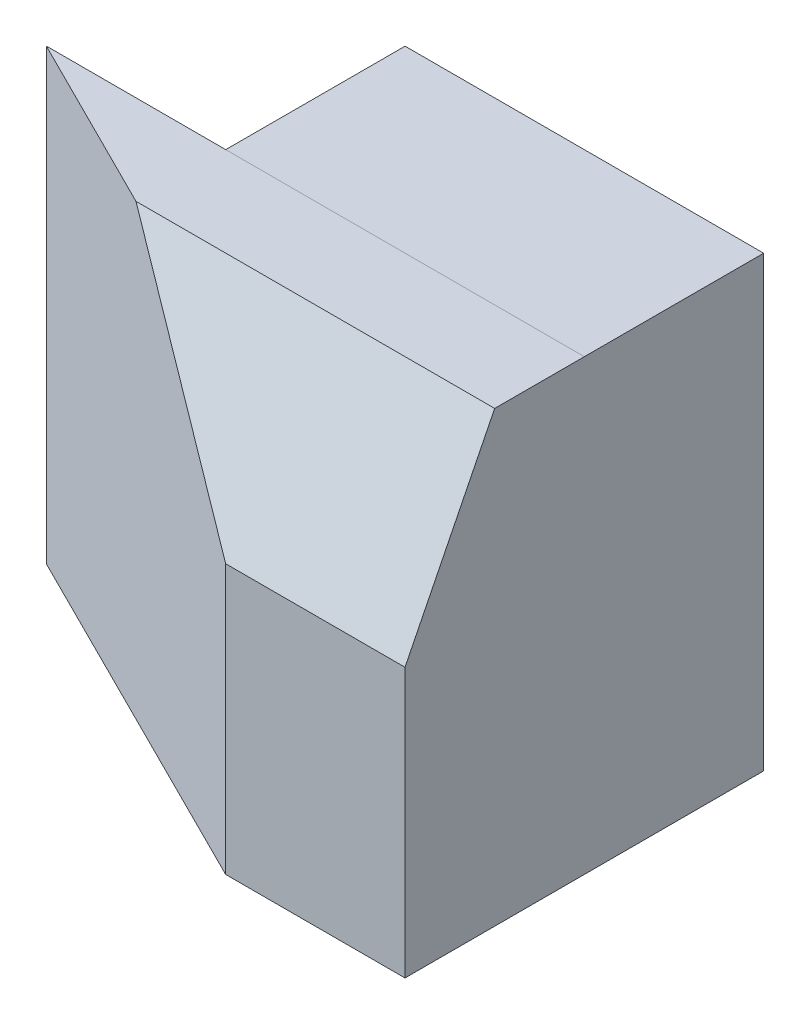
ISO-10303-21;
HEADER;
FILE_DESCRIPTION(('STEP AP214'),'2;1');
FILE_NAME('part.step','',(''),(''),'','','');
FILE_SCHEMA(('AUTOMOTIVE_DESIGN { 1 0 10303 214 1 1 1 1 }'));
ENDSEC;
DATA;
#1=APPLICATION_CONTEXT('core data for automotive mechanical design processes');
#2=APPLICATION_PROTOCOL_DEFINITION('international standard','automotive_design',2000,#1);
#3=PRODUCT_CONTEXT('',#1,'mechanical');
#4=PRODUCT('Part','Part','',(#3));
#5=PRODUCT_RELATED_PRODUCT_CATEGORY('part','',(#4));
#6=PRODUCT_DEFINITION_FORMATION('','',#4);
#7=PRODUCT_DEFINITION_CONTEXT('part definition',#1,'design');
#8=PRODUCT_DEFINITION('design','',#6,#7);
#9=PRODUCT_DEFINITION_SHAPE('','',#8);
#10=(LENGTH_UNIT() NAMED_UNIT(*) SI_UNIT(.MILLI.,.METRE.));
#11=(NAMED_UNIT(*) PLANE_ANGLE_UNIT() SI_UNIT($,.RADIAN.));
#12=(NAMED_UNIT(*) SI_UNIT($,.STERADIAN.) SOLID_ANGLE_UNIT());
#13=UNCERTAINTY_MEASURE_WITH_UNIT(LENGTH_MEASURE(1.E-05),#10,'distance_accuracy_value','');
#14=(GEOMETRIC_REPRESENTATION_CONTEXT(3) GLOBAL_UNCERTAINTY_ASSIGNED_CONTEXT((#13)) GLOBAL_UNIT_ASSIGNED_CONTEXT((#10,
#11,#12)) REPRESENTATION_CONTEXT('',''));
#15=CARTESIAN_POINT('',(0.,0.,0.));
#16=DIRECTION('',(0.,0.,1.));
#17=DIRECTION('',(1.,0.,0.));
#18=AXIS2_PLACEMENT_3D('',#15,#16,#17);
#19=CARTESIAN_POINT('',(0.,0.,2.));
#20=DIRECTION('',(0.,1.,0.));
#21=DIRECTION('',(0.,0.,1.));
#22=AXIS2_PLACEMENT_3D('',#19,#20,#21);
#23=PLANE('',#22);
#24=DIRECTION('',(-1.,0.,0.));
#25=VECTOR('',#24,1.);
#26=CARTESIAN_POINT('',(4.,0.,2.));
#27=LINE('',#26,#25);
#28=CARTESIAN_POINT('',(4.,0.,2.));
#29=VERTEX_POINT('',#28);
#30=CARTESIAN_POINT('',(0.,0.,2.));
#31=VERTEX_POINT('',#30);
#32=EDGE_CURVE('E111',#29,#31,#27,.T.);
#33=ORIENTED_EDGE('',*,*,#32,.F.);
#34=DIRECTION('',(0.,0.,-1.));
#35=VECTOR('',#34,1.);
#36=CARTESIAN_POINT('',(4.,0.,2.));
#37=LINE('',#36,#35);
#38=CARTESIAN_POINT('',(4.,0.,0.));
#39=VERTEX_POINT('',#38);
#40=EDGE_CURVE('E110',#29,#39,#37,.T.);
#41=ORIENTED_EDGE('',*,*,#40,.T.);
#42=DIRECTION('',(1.,0.,0.));
#43=VECTOR('',#42,1.);
#44=CARTESIAN_POINT('',(0.,0.,0.));
#45=LINE('',#44,#43);
#46=CARTESIAN_POINT('',(6.,0.,0.));
#47=VERTEX_POINT('',#46);
#48=EDGE_CURVE('E244',#39,#47,#45,.T.);
#49=ORIENTED_EDGE('',*,*,#48,.T.);
#50=DIRECTION('',(0.,0.,-1.));
#51=VECTOR('',#50,1.);
#52=CARTESIAN_POINT('',(6.,0.,2.));
#53=LINE('',#52,#51);
#54=CARTESIAN_POINT('',(6.,0.,4.));
#55=VERTEX_POINT('',#54);
#56=EDGE_CURVE('E180',#55,#47,#53,.T.);
#57=ORIENTED_EDGE('',*,*,#56,.F.);
#58=DIRECTION('',(1.,0.,0.));
#59=VECTOR('',#58,1.);
#60=CARTESIAN_POINT('',(6.,0.,4.));
#61=LINE('',#60,#59);
#62=CARTESIAN_POINT('',(4.,0.,4.));
#63=VERTEX_POINT('',#62);
#64=EDGE_CURVE('E160',#63,#55,#61,.T.);
#65=ORIENTED_EDGE('',*,*,#64,.F.);
#66=DIRECTION('',(-0.894427190999916,0.,-0.447213595499958));
#67=VECTOR('',#66,1.);
#68=CARTESIAN_POINT('',(4.,0.,4.));
#69=LINE('',#68,#67);
#70=EDGE_CURVE('E147',#63,#31,#69,.T.);
#71=ORIENTED_EDGE('',*,*,#70,.T.);
#72=EDGE_LOOP('',(#33,#41,#49,#57,#65,#71));
#73=FACE_BOUND('',#72,.T.);
#74=ADVANCED_FACE('F38',(#73),#23,.F.);
#75=CARTESIAN_POINT('',(6.,5.00106876189932,4.));
#76=DIRECTION('',(0.,-1.,0.));
#77=DIRECTION('',(0.,0.,-1.));
#78=AXIS2_PLACEMENT_3D('',#75,#76,#77);
#79=PLANE('',#78);
#80=DIRECTION('',(-0.894427190999916,0.,-0.447213595499958));
#81=VECTOR('',#80,1.);
#82=CARTESIAN_POINT('',(2.,5.00106876189932,3.));
#83=LINE('',#82,#81);
#84=CARTESIAN_POINT('',(2.,5.00106876189932,3.));
#85=VERTEX_POINT('',#84);
#86=CARTESIAN_POINT('',(0.,5.00106876189932,2.));
#87=VERTEX_POINT('',#86);
#88=EDGE_CURVE('E133',#85,#87,#83,.T.);
#89=ORIENTED_EDGE('',*,*,#88,.F.);
#90=DIRECTION('',(1.,0.,0.));
#91=VECTOR('',#90,1.);
#92=CARTESIAN_POINT('',(6.,5.00106876189932,3.));
#93=LINE('',#92,#91);
#94=CARTESIAN_POINT('',(6.,5.00106876189932,3.));
#95=VERTEX_POINT('',#94);
#96=EDGE_CURVE('E188',#85,#95,#93,.T.);
#97=ORIENTED_EDGE('',*,*,#96,.T.);
#98=DIRECTION('',(0.,0.,-1.));
#99=VECTOR('',#98,1.);
#100=CARTESIAN_POINT('',(6.,5.00106876189932,4.));
#101=LINE('',#100,#99);
#102=CARTESIAN_POINT('',(6.,5.00053438094966,2.));
#103=VERTEX_POINT('',#102);
#104=EDGE_CURVE('E167',#95,#103,#101,.T.);
#105=ORIENTED_EDGE('',*,*,#104,.T.);
#106=CARTESIAN_POINT('',(6.,5.00106876189932,2.));
#107=DIRECTION('',(-1.,0.,0.));
#108=VECTOR('',#107,1.);
#109=LINE('',#106,#108);
#110=CARTESIAN_POINT('',(2.00053438094966,5.00053438094966,2.));
#111=VERTEX_POINT('',#110);
#112=EDGE_CURVE('E195',#103,#111,#109,.T.);
#113=ORIENTED_EDGE('',*,*,#112,.T.);
#114=DIRECTION('',(1.,0.,0.));
#115=VECTOR('',#114,1.);
#116=CARTESIAN_POINT('',(0.,5.00106876189932,2.));
#117=LINE('',#116,#115);
#118=EDGE_CURVE('E123',#87,#111,#117,.T.);
#119=ORIENTED_EDGE('',*,*,#118,.F.);
#120=EDGE_LOOP('',(#89,#97,#105,#113,#119));
#121=FACE_BOUND('',#120,.T.);
#122=ADVANCED_FACE('F223',(#121),#79,.F.);
#123=CARTESIAN_POINT('',(0.,0.,4.));
#124=DIRECTION('',(0.,0.,1.));
#125=DIRECTION('',(1.,0.,0.));
#126=AXIS2_PLACEMENT_3D('',#123,#124,#125);
#127=PLANE('',#126);
#128=DIRECTION('',(-1.,0.,0.));
#129=VECTOR('',#128,1.);
#130=CARTESIAN_POINT('',(0.,3.00106876189932,4.));
#131=LINE('',#130,#129);
#132=CARTESIAN_POINT('',(6.,3.00106876189932,4.));
#133=VERTEX_POINT('',#132);
#134=CARTESIAN_POINT('',(4.,3.00106876189932,4.));
#135=VERTEX_POINT('',#134);
#136=EDGE_CURVE('E168',#133,#135,#131,.T.);
#137=ORIENTED_EDGE('',*,*,#136,.T.);
#138=DIRECTION('',(0.,-1.,0.));
#139=VECTOR('',#138,1.);
#140=CARTESIAN_POINT('',(4.,3.00106876189932,4.));
#141=LINE('',#140,#139);
#142=EDGE_CURVE('E56',#135,#63,#141,.T.);
#143=ORIENTED_EDGE('',*,*,#142,.T.);
#144=ORIENTED_EDGE('',*,*,#64,.T.);
#145=DIRECTION('',(0.,1.,0.));
#146=VECTOR('',#145,1.);
#147=CARTESIAN_POINT('',(6.,0.,4.));
#148=LINE('',#147,#146);
#149=EDGE_CURVE('E138',#55,#133,#148,.T.);
#150=ORIENTED_EDGE('',*,*,#149,.T.);
#151=EDGE_LOOP('',(#137,#143,#144,#150));
#152=FACE_BOUND('',#151,.T.);
#153=ADVANCED_FACE('F184',(#152),#127,.T.);
#154=CARTESIAN_POINT('',(0.,3.00106876189932,4.));
#155=DIRECTION('',(0.,0.447213595499958,0.894427190999916));
#156=DIRECTION('',(1.,0.,0.));
#157=AXIS2_PLACEMENT_3D('',#154,#155,#156);
#158=PLANE('',#157);
#159=ORIENTED_EDGE('',*,*,#96,.F.);
#160=DIRECTION('',(0.666666666666667,-0.666666666666667,0.333333333333333));
#161=VECTOR('',#160,1.);
#162=CARTESIAN_POINT('',(2.,5.00106876189932,3.));
#163=LINE('',#162,#161);
#164=EDGE_CURVE('E136',#85,#135,#163,.T.);
#165=ORIENTED_EDGE('',*,*,#164,.T.);
#166=ORIENTED_EDGE('',*,*,#136,.F.);
#167=DIRECTION('',(0.,-0.894427190999916,0.447213595499958));
#168=VECTOR('',#167,1.);
#169=CARTESIAN_POINT('',(6.,3.00106876189932,4.));
#170=LINE('',#169,#168);
#171=EDGE_CURVE('E48',#95,#133,#170,.T.);
#172=ORIENTED_EDGE('',*,*,#171,.F.);
#173=EDGE_LOOP('',(#159,#165,#166,#172));
#174=FACE_BOUND('',#173,.T.);
#175=ADVANCED_FACE('F40',(#174),#158,.T.);
#176=CARTESIAN_POINT('',(6.,0.,2.));
#177=DIRECTION('',(-1.,0.,0.));
#178=DIRECTION('',(0.,0.,1.));
#179=AXIS2_PLACEMENT_3D('',#176,#177,#178);
#180=PLANE('',#179);
#181=ORIENTED_EDGE('',*,*,#104,.F.);
#182=ORIENTED_EDGE('',*,*,#171,.T.);
#183=ORIENTED_EDGE('',*,*,#149,.F.);
#184=ORIENTED_EDGE('',*,*,#56,.T.);
#185=DIRECTION('',(0.,1.,0.));
#186=VECTOR('',#185,1.);
#187=CARTESIAN_POINT('',(6.,0.,0.));
#188=LINE('',#187,#186);
#189=CARTESIAN_POINT('',(6.,5.,0.));
#190=VERTEX_POINT('',#189);
#191=EDGE_CURVE('E254',#47,#190,#188,.T.);
#192=ORIENTED_EDGE('',*,*,#191,.T.);
#193=DIRECTION('',(0.,0.,-1.));
#194=VECTOR('',#193,1.);
#195=CARTESIAN_POINT('',(6.,5.,2.));
#196=LINE('',#195,#194);
#197=EDGE_CURVE('E189',#103,#190,#196,.T.);
#198=ORIENTED_EDGE('',*,*,#197,.F.);
#199=EDGE_LOOP('',(#181,#182,#183,#184,#192,#198));
#200=FACE_BOUND('',#199,.T.);
#201=ADVANCED_FACE('F219',(#200),#180,.F.);
#202=CARTESIAN_POINT('',(2.,5.,2.));
#203=DIRECTION('',(0.,-1.,0.));
#204=DIRECTION('',(0.,0.,-1.));
#205=AXIS2_PLACEMENT_3D('',#202,#203,#204);
#206=PLANE('',#205);
#207=DIRECTION('',(-1.,0.,0.));
#208=VECTOR('',#207,1.);
#209=CARTESIAN_POINT('',(2.,5.,0.));
#210=LINE('',#209,#208);
#211=CARTESIAN_POINT('',(2.00106876189932,5.,0.));
#212=VERTEX_POINT('',#211);
#213=EDGE_CURVE('E199',#190,#212,#210,.T.);
#214=ORIENTED_EDGE('',*,*,#213,.T.);
#215=DIRECTION('',(0.,0.,1.));
#216=VECTOR('',#215,1.);
#217=CARTESIAN_POINT('',(2.00106876189932,5.,2.));
#218=LINE('',#217,#216);
#219=EDGE_CURVE('E131',#212,#111,#218,.T.);
#220=ORIENTED_EDGE('',*,*,#219,.T.);
#221=ORIENTED_EDGE('',*,*,#112,.F.);
#222=ORIENTED_EDGE('',*,*,#197,.T.);
#223=EDGE_LOOP('',(#214,#220,#221,#222));
#224=FACE_BOUND('',#223,.T.);
#225=ADVANCED_FACE('F208',(#224),#206,.F.);
#226=CARTESIAN_POINT('',(0.,0.,0.));
#227=DIRECTION('',(0.,0.,1.));
#228=DIRECTION('',(1.,0.,0.));
#229=AXIS2_PLACEMENT_3D('',#226,#227,#228);
#230=PLANE('',#229);
#231=ORIENTED_EDGE('',*,*,#48,.F.);
#232=DIRECTION('',(0.,-1.,0.));
#233=VECTOR('',#232,1.);
#234=CARTESIAN_POINT('',(4.,3.00106876189932,0.));
#235=LINE('',#234,#233);
#236=CARTESIAN_POINT('',(4.,3.00106876189932,0.));
#237=VERTEX_POINT('',#236);
#238=EDGE_CURVE('E126',#237,#39,#235,.T.);
#239=ORIENTED_EDGE('',*,*,#238,.F.);
#240=DIRECTION('',(-0.707106781186548,0.707106781186548,0.));
#241=VECTOR('',#240,1.);
#242=CARTESIAN_POINT('',(3.50053438094966,3.50053438094966,0.));
#243=LINE('',#242,#241);
#244=EDGE_CURVE('E14',#237,#212,#243,.T.);
#245=ORIENTED_EDGE('',*,*,#244,.T.);
#246=ORIENTED_EDGE('',*,*,#213,.F.);
#247=ORIENTED_EDGE('',*,*,#191,.F.);
#248=EDGE_LOOP('',(#231,#239,#245,#246,#247));
#249=FACE_BOUND('',#248,.T.);
#250=ADVANCED_FACE('F218',(#249),#230,.F.);
#251=CARTESIAN_POINT('',(-0.8,0.,1.6));
#252=DIRECTION('',(-0.447213595499958,0.,0.894427190999916));
#253=DIRECTION('',(0.894427190999916,0.,0.447213595499958));
#254=AXIS2_PLACEMENT_3D('',#251,#252,#253);
#255=PLANE('',#254);
#256=ORIENTED_EDGE('',*,*,#164,.F.);
#257=ORIENTED_EDGE('',*,*,#88,.T.);
#258=DIRECTION('',(0.,-1.,0.));
#259=VECTOR('',#258,1.);
#260=CARTESIAN_POINT('',(0.,5.00106876189932,2.));
#261=LINE('',#260,#259);
#262=EDGE_CURVE('E143',#87,#31,#261,.T.);
#263=ORIENTED_EDGE('',*,*,#262,.T.);
#264=ORIENTED_EDGE('',*,*,#70,.F.);
#265=ORIENTED_EDGE('',*,*,#142,.F.);
#266=EDGE_LOOP('',(#256,#257,#263,#264,#265));
#267=FACE_BOUND('',#266,.T.);
#268=ADVANCED_FACE('F175',(#267),#255,.T.);
#269=CARTESIAN_POINT('',(2.,5.00106876189932,2.));
#270=DIRECTION('',(0.707106781186547,0.707106781186547,0.));
#271=DIRECTION('',(-0.707106781186548,0.707106781186548,0.));
#272=AXIS2_PLACEMENT_3D('',#269,#270,#271);
#273=PLANE('',#272);
#274=ORIENTED_EDGE('',*,*,#244,.F.);
#275=DIRECTION('',(0.,0.,-1.));
#276=VECTOR('',#275,1.);
#277=CARTESIAN_POINT('',(4.,3.00106876189932,2.));
#278=LINE('',#277,#276);
#279=CARTESIAN_POINT('',(4.,3.00106876189932,2.));
#280=VERTEX_POINT('',#279);
#281=EDGE_CURVE('E102',#280,#237,#278,.T.);
#282=ORIENTED_EDGE('',*,*,#281,.F.);
#283=DIRECTION('',(0.707106781186548,-0.707106781186548,0.));
#284=VECTOR('',#283,1.);
#285=CARTESIAN_POINT('',(2.,5.00106876189932,2.));
#286=LINE('',#285,#284);
#287=EDGE_CURVE('E106',#111,#280,#286,.T.);
#288=ORIENTED_EDGE('',*,*,#287,.F.);
#289=ORIENTED_EDGE('',*,*,#219,.F.);
#290=EDGE_LOOP('',(#274,#282,#288,#289));
#291=FACE_BOUND('',#290,.T.);
#292=ADVANCED_FACE('F104',(#291),#273,.F.);
#293=CARTESIAN_POINT('',(4.,3.00106876189932,2.));
#294=DIRECTION('',(1.,0.,0.));
#295=DIRECTION('',(0.,0.,-1.));
#296=AXIS2_PLACEMENT_3D('',#293,#294,#295);
#297=PLANE('',#296);
#298=ORIENTED_EDGE('',*,*,#238,.T.);
#299=ORIENTED_EDGE('',*,*,#40,.F.);
#300=DIRECTION('',(0.,-1.,0.));
#301=VECTOR('',#300,1.);
#302=CARTESIAN_POINT('',(4.,3.00106876189932,2.));
#303=LINE('',#302,#301);
#304=EDGE_CURVE('E114',#280,#29,#303,.T.);
#305=ORIENTED_EDGE('',*,*,#304,.F.);
#306=ORIENTED_EDGE('',*,*,#281,.T.);
#307=EDGE_LOOP('',(#298,#299,#305,#306));
#308=FACE_BOUND('',#307,.T.);
#309=ADVANCED_FACE('F115',(#308),#297,.F.);
#310=CARTESIAN_POINT('',(0.,0.,2.));
#311=DIRECTION('',(0.,0.,1.));
#312=DIRECTION('',(1.,0.,0.));
#313=AXIS2_PLACEMENT_3D('',#310,#311,#312);
#314=PLANE('',#313);
#315=ORIENTED_EDGE('',*,*,#262,.F.);
#316=ORIENTED_EDGE('',*,*,#118,.T.);
#317=ORIENTED_EDGE('',*,*,#287,.T.);
#318=ORIENTED_EDGE('',*,*,#304,.T.);
#319=ORIENTED_EDGE('',*,*,#32,.T.);
#320=EDGE_LOOP('',(#315,#316,#317,#318,#319));
#321=FACE_BOUND('',#320,.T.);
#322=ADVANCED_FACE('F121',(#321),#314,.F.);
#323=CLOSED_SHELL('',(#74,#122,#153,#175,#201,#225,#250,#268,#292,#309,#322));
#324=MANIFOLD_SOLID_BREP('B2',#323);
#325=ADVANCED_BREP_SHAPE_REPRESENTATION('',(#18,#324),#14);
#326=SHAPE_DEFINITION_REPRESENTATION(#9,#325);
ENDSEC;
END-ISO-10303-21;
